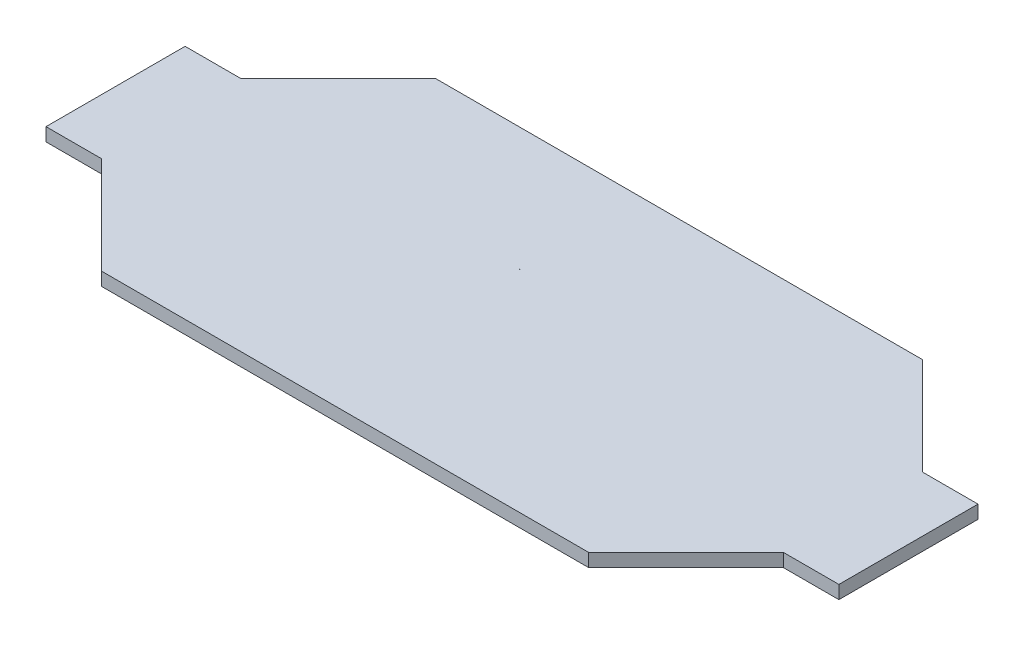
ISO-10303-21;
HEADER;
FILE_DESCRIPTION(('STEP AP214'),'2;1');
FILE_NAME('part.step','',(''),(''),'','','');
FILE_SCHEMA(('AUTOMOTIVE_DESIGN { 1 0 10303 214 1 1 1 1 }'));
ENDSEC;
DATA;
#1=APPLICATION_CONTEXT('core data for automotive mechanical design processes');
#2=APPLICATION_PROTOCOL_DEFINITION('international standard','automotive_design',2000,#1);
#3=PRODUCT_CONTEXT('',#1,'mechanical');
#4=PRODUCT('Part','Part','',(#3));
#5=PRODUCT_RELATED_PRODUCT_CATEGORY('part','',(#4));
#6=PRODUCT_DEFINITION_FORMATION('','',#4);
#7=PRODUCT_DEFINITION_CONTEXT('part definition',#1,'design');
#8=PRODUCT_DEFINITION('design','',#6,#7);
#9=PRODUCT_DEFINITION_SHAPE('','',#8);
#10=(LENGTH_UNIT() NAMED_UNIT(*) SI_UNIT(.MILLI.,.METRE.));
#11=(NAMED_UNIT(*) PLANE_ANGLE_UNIT() SI_UNIT($,.RADIAN.));
#12=(NAMED_UNIT(*) SI_UNIT($,.STERADIAN.) SOLID_ANGLE_UNIT());
#13=UNCERTAINTY_MEASURE_WITH_UNIT(LENGTH_MEASURE(1.E-05),#10,'distance_accuracy_value','');
#14=(GEOMETRIC_REPRESENTATION_CONTEXT(3) GLOBAL_UNCERTAINTY_ASSIGNED_CONTEXT((#13)) GLOBAL_UNIT_ASSIGNED_CONTEXT((#10,
#11,#12)) REPRESENTATION_CONTEXT('',''));
#15=CARTESIAN_POINT('',(0.,0.,0.));
#16=DIRECTION('',(0.,0.,1.));
#17=DIRECTION('',(1.,0.,0.));
#18=AXIS2_PLACEMENT_3D('',#15,#16,#17);
#19=CARTESIAN_POINT('',(-67.4999999999996,4.75,-67.5000000000001));
#20=DIRECTION('',(-0.707106781186545,0.,-0.70710678118655));
#21=DIRECTION('',(-0.70710678118655,0.,0.707106781186545));
#22=AXIS2_PLACEMENT_3D('',#19,#20,#21);
#23=PLANE('',#22);
#24=DIRECTION('',(0.70710678118655,0.,-0.707106781186545));
#25=VECTOR('',#24,1.);
#26=CARTESIAN_POINT('',(-67.4999999999996,0.,-67.5000000000001));
#27=LINE('',#26,#25);
#28=CARTESIAN_POINT('',(-110.,0.,-25.));
#29=VERTEX_POINT('',#28);
#30=CARTESIAN_POINT('',(-74.9999999999997,0.,-60.));
#31=VERTEX_POINT('',#30);
#32=EDGE_CURVE('E181',#29,#31,#27,.T.);
#33=ORIENTED_EDGE('',*,*,#32,.F.);
#34=DIRECTION('',(0.,-1.,0.));
#35=VECTOR('',#34,1.);
#36=CARTESIAN_POINT('',(-110.,4.75,-25.));
#37=LINE('',#36,#35);
#38=CARTESIAN_POINT('',(-110.,4.75,-25.));
#39=VERTEX_POINT('',#38);
#40=EDGE_CURVE('E11',#39,#29,#37,.T.);
#41=ORIENTED_EDGE('',*,*,#40,.F.);
#42=DIRECTION('',(0.70710678118655,0.,-0.707106781186545));
#43=VECTOR('',#42,1.);
#44=CARTESIAN_POINT('',(-67.4999999999996,4.75,-67.5000000000001));
#45=LINE('',#44,#43);
#46=CARTESIAN_POINT('',(-74.9999999999997,4.75,-60.));
#47=VERTEX_POINT('',#46);
#48=EDGE_CURVE('E293',#39,#47,#45,.T.);
#49=ORIENTED_EDGE('',*,*,#48,.T.);
#50=DIRECTION('',(0.,-1.,0.));
#51=VECTOR('',#50,1.);
#52=CARTESIAN_POINT('',(-74.9999999999997,4.75,-60.));
#53=LINE('',#52,#51);
#54=EDGE_CURVE('E57',#47,#31,#53,.T.);
#55=ORIENTED_EDGE('',*,*,#54,.T.);
#56=EDGE_LOOP('',(#33,#41,#49,#55));
#57=FACE_BOUND('',#56,.T.);
#58=ADVANCED_FACE('F38',(#57),#23,.T.);
#59=CARTESIAN_POINT('',(0.,4.75,-25.));
#60=DIRECTION('',(0.,0.,-1.));
#61=DIRECTION('',(-1.,0.,0.));
#62=AXIS2_PLACEMENT_3D('',#59,#60,#61);
#63=PLANE('',#62);
#64=DIRECTION('',(1.,0.,0.));
#65=VECTOR('',#64,1.);
#66=CARTESIAN_POINT('',(0.,0.,-25.));
#67=LINE('',#66,#65);
#68=CARTESIAN_POINT('',(-130.,0.,-25.));
#69=VERTEX_POINT('',#68);
#70=EDGE_CURVE('E183',#69,#29,#67,.T.);
#71=ORIENTED_EDGE('',*,*,#70,.F.);
#72=DIRECTION('',(0.,-1.,0.));
#73=VECTOR('',#72,1.);
#74=CARTESIAN_POINT('',(-130.,4.75,-25.));
#75=LINE('',#74,#73);
#76=CARTESIAN_POINT('',(-130.,4.75,-25.));
#77=VERTEX_POINT('',#76);
#78=EDGE_CURVE('E48',#77,#69,#75,.T.);
#79=ORIENTED_EDGE('',*,*,#78,.F.);
#80=DIRECTION('',(1.,0.,0.));
#81=VECTOR('',#80,1.);
#82=CARTESIAN_POINT('',(0.,4.75,-25.));
#83=LINE('',#82,#81);
#84=EDGE_CURVE('E297',#77,#39,#83,.T.);
#85=ORIENTED_EDGE('',*,*,#84,.T.);
#86=ORIENTED_EDGE('',*,*,#40,.T.);
#87=EDGE_LOOP('',(#71,#79,#85,#86));
#88=FACE_BOUND('',#87,.T.);
#89=ADVANCED_FACE('F246',(#88),#63,.T.);
#90=CARTESIAN_POINT('',(-130.,4.75,0.));
#91=DIRECTION('',(-1.,0.,0.));
#92=DIRECTION('',(0.,0.,1.));
#93=AXIS2_PLACEMENT_3D('',#90,#91,#92);
#94=PLANE('',#93);
#95=DIRECTION('',(0.,0.,-1.));
#96=VECTOR('',#95,1.);
#97=CARTESIAN_POINT('',(-130.,0.,0.));
#98=LINE('',#97,#96);
#99=CARTESIAN_POINT('',(-130.,0.,25.));
#100=VERTEX_POINT('',#99);
#101=EDGE_CURVE('E186',#100,#69,#98,.T.);
#102=ORIENTED_EDGE('',*,*,#101,.F.);
#103=DIRECTION('',(0.,-1.,0.));
#104=VECTOR('',#103,1.);
#105=CARTESIAN_POINT('',(-130.,4.75,25.));
#106=LINE('',#105,#104);
#107=CARTESIAN_POINT('',(-130.,4.75,25.));
#108=VERTEX_POINT('',#107);
#109=EDGE_CURVE('E227',#108,#100,#106,.T.);
#110=ORIENTED_EDGE('',*,*,#109,.F.);
#111=DIRECTION('',(0.,0.,-1.));
#112=VECTOR('',#111,1.);
#113=CARTESIAN_POINT('',(-130.,4.75,0.));
#114=LINE('',#113,#112);
#115=EDGE_CURVE('E300',#108,#77,#114,.T.);
#116=ORIENTED_EDGE('',*,*,#115,.T.);
#117=ORIENTED_EDGE('',*,*,#78,.T.);
#118=EDGE_LOOP('',(#102,#110,#116,#117));
#119=FACE_BOUND('',#118,.T.);
#120=ADVANCED_FACE('F251',(#119),#94,.T.);
#121=CARTESIAN_POINT('',(0.,4.75,25.));
#122=DIRECTION('',(0.,0.,1.));
#123=DIRECTION('',(1.,0.,0.));
#124=AXIS2_PLACEMENT_3D('',#121,#122,#123);
#125=PLANE('',#124);
#126=DIRECTION('',(-1.,0.,0.));
#127=VECTOR('',#126,1.);
#128=CARTESIAN_POINT('',(0.,0.,25.));
#129=LINE('',#128,#127);
#130=CARTESIAN_POINT('',(-110.,0.,25.));
#131=VERTEX_POINT('',#130);
#132=EDGE_CURVE('E189',#131,#100,#129,.T.);
#133=ORIENTED_EDGE('',*,*,#132,.F.);
#134=DIRECTION('',(0.,-1.,0.));
#135=VECTOR('',#134,1.);
#136=CARTESIAN_POINT('',(-110.,4.75,25.));
#137=LINE('',#136,#135);
#138=CARTESIAN_POINT('',(-110.,4.75,25.));
#139=VERTEX_POINT('',#138);
#140=EDGE_CURVE('E225',#139,#131,#137,.T.);
#141=ORIENTED_EDGE('',*,*,#140,.F.);
#142=DIRECTION('',(-1.,0.,0.));
#143=VECTOR('',#142,1.);
#144=CARTESIAN_POINT('',(0.,4.75,25.));
#145=LINE('',#144,#143);
#146=EDGE_CURVE('E303',#139,#108,#145,.T.);
#147=ORIENTED_EDGE('',*,*,#146,.T.);
#148=ORIENTED_EDGE('',*,*,#109,.T.);
#149=EDGE_LOOP('',(#133,#141,#147,#148));
#150=FACE_BOUND('',#149,.T.);
#151=ADVANCED_FACE('F257',(#150),#125,.T.);
#152=CARTESIAN_POINT('',(-67.5000000000011,4.75,67.4999999999998));
#153=DIRECTION('',(-0.707106781186554,0.,0.707106781186541));
#154=DIRECTION('',(0.707106781186541,0.,0.707106781186554));
#155=AXIS2_PLACEMENT_3D('',#152,#153,#154);
#156=PLANE('',#155);
#157=DIRECTION('',(-0.707106781186541,0.,-0.707106781186554));
#158=VECTOR('',#157,1.);
#159=CARTESIAN_POINT('',(-67.5000000000011,0.,67.4999999999998));
#160=LINE('',#159,#158);
#161=CARTESIAN_POINT('',(-75.0000000000007,0.,60.));
#162=VERTEX_POINT('',#161);
#163=EDGE_CURVE('E192',#162,#131,#160,.T.);
#164=ORIENTED_EDGE('',*,*,#163,.F.);
#165=DIRECTION('',(0.,-1.,0.));
#166=VECTOR('',#165,1.);
#167=CARTESIAN_POINT('',(-75.0000000000007,4.75,60.));
#168=LINE('',#167,#166);
#169=CARTESIAN_POINT('',(-75.0000000000007,4.75,60.));
#170=VERTEX_POINT('',#169);
#171=EDGE_CURVE('E223',#170,#162,#168,.T.);
#172=ORIENTED_EDGE('',*,*,#171,.F.);
#173=DIRECTION('',(-0.707106781186541,0.,-0.707106781186554));
#174=VECTOR('',#173,1.);
#175=CARTESIAN_POINT('',(-67.5000000000011,4.75,67.4999999999998));
#176=LINE('',#175,#174);
#177=EDGE_CURVE('E306',#170,#139,#176,.T.);
#178=ORIENTED_EDGE('',*,*,#177,.T.);
#179=ORIENTED_EDGE('',*,*,#140,.T.);
#180=EDGE_LOOP('',(#164,#172,#178,#179));
#181=FACE_BOUND('',#180,.T.);
#182=ADVANCED_FACE('F261',(#181),#156,.T.);
#183=CARTESIAN_POINT('',(0.,4.75,60.));
#184=DIRECTION('',(0.,0.,1.));
#185=DIRECTION('',(1.,0.,0.));
#186=AXIS2_PLACEMENT_3D('',#183,#184,#185);
#187=PLANE('',#186);
#188=DIRECTION('',(-1.,0.,0.));
#189=VECTOR('',#188,1.);
#190=CARTESIAN_POINT('',(0.,0.,60.));
#191=LINE('',#190,#189);
#192=CARTESIAN_POINT('',(99.9999999999993,0.,60.));
#193=VERTEX_POINT('',#192);
#194=EDGE_CURVE('E195',#193,#162,#191,.T.);
#195=ORIENTED_EDGE('',*,*,#194,.F.);
#196=DIRECTION('',(0.,-1.,0.));
#197=VECTOR('',#196,1.);
#198=CARTESIAN_POINT('',(99.9999999999993,4.75,60.));
#199=LINE('',#198,#197);
#200=CARTESIAN_POINT('',(99.9999999999993,4.75,60.));
#201=VERTEX_POINT('',#200);
#202=EDGE_CURVE('E221',#201,#193,#199,.T.);
#203=ORIENTED_EDGE('',*,*,#202,.F.);
#204=DIRECTION('',(-1.,0.,0.));
#205=VECTOR('',#204,1.);
#206=CARTESIAN_POINT('',(0.,4.75,60.));
#207=LINE('',#206,#205);
#208=EDGE_CURVE('E309',#201,#170,#207,.T.);
#209=ORIENTED_EDGE('',*,*,#208,.T.);
#210=ORIENTED_EDGE('',*,*,#171,.T.);
#211=EDGE_LOOP('',(#195,#203,#209,#210));
#212=FACE_BOUND('',#211,.T.);
#213=ADVANCED_FACE('F265',(#212),#187,.T.);
#214=CARTESIAN_POINT('',(79.9999999999987,4.75,80.0000000000002));
#215=DIRECTION('',(0.707106781186541,0.,0.707106781186554));
#216=DIRECTION('',(0.707106781186554,0.,-0.707106781186541));
#217=AXIS2_PLACEMENT_3D('',#214,#215,#216);
#218=PLANE('',#217);
#219=DIRECTION('',(-0.707106781186554,0.,0.707106781186541));
#220=VECTOR('',#219,1.);
#221=CARTESIAN_POINT('',(79.9999999999987,0.,80.0000000000002));
#222=LINE('',#221,#220);
#223=CARTESIAN_POINT('',(134.999999999999,0.,25.0000000000007));
#224=VERTEX_POINT('',#223);
#225=EDGE_CURVE('E198',#224,#193,#222,.T.);
#226=ORIENTED_EDGE('',*,*,#225,.F.);
#227=DIRECTION('',(0.,-1.,0.));
#228=VECTOR('',#227,1.);
#229=CARTESIAN_POINT('',(134.999999999999,4.75,25.0000000000007));
#230=LINE('',#229,#228);
#231=CARTESIAN_POINT('',(134.999999999999,4.75,25.0000000000007));
#232=VERTEX_POINT('',#231);
#233=EDGE_CURVE('E219',#232,#224,#230,.T.);
#234=ORIENTED_EDGE('',*,*,#233,.F.);
#235=DIRECTION('',(-0.707106781186554,0.,0.707106781186541));
#236=VECTOR('',#235,1.);
#237=CARTESIAN_POINT('',(79.9999999999987,4.75,80.0000000000002));
#238=LINE('',#237,#236);
#239=EDGE_CURVE('E312',#232,#201,#238,.T.);
#240=ORIENTED_EDGE('',*,*,#239,.T.);
#241=ORIENTED_EDGE('',*,*,#202,.T.);
#242=EDGE_LOOP('',(#226,#234,#240,#241));
#243=FACE_BOUND('',#242,.T.);
#244=ADVANCED_FACE('F269',(#243),#218,.T.);
#245=CARTESIAN_POINT('',(0.,4.75,25.0000000000007));
#246=DIRECTION('',(0.,0.,1.));
#247=DIRECTION('',(1.,0.,0.));
#248=AXIS2_PLACEMENT_3D('',#245,#246,#247);
#249=PLANE('',#248);
#250=DIRECTION('',(-1.,0.,0.));
#251=VECTOR('',#250,1.);
#252=CARTESIAN_POINT('',(0.,0.,25.0000000000007));
#253=LINE('',#252,#251);
#254=CARTESIAN_POINT('',(154.999999999999,0.,25.0000000000007));
#255=VERTEX_POINT('',#254);
#256=EDGE_CURVE('E201',#255,#224,#253,.T.);
#257=ORIENTED_EDGE('',*,*,#256,.F.);
#258=DIRECTION('',(0.,-1.,0.));
#259=VECTOR('',#258,1.);
#260=CARTESIAN_POINT('',(154.999999999999,4.75,25.0000000000007));
#261=LINE('',#260,#259);
#262=CARTESIAN_POINT('',(154.999999999999,4.75,25.0000000000007));
#263=VERTEX_POINT('',#262);
#264=EDGE_CURVE('E217',#263,#255,#261,.T.);
#265=ORIENTED_EDGE('',*,*,#264,.F.);
#266=DIRECTION('',(-1.,0.,0.));
#267=VECTOR('',#266,1.);
#268=CARTESIAN_POINT('',(0.,4.75,25.0000000000007));
#269=LINE('',#268,#267);
#270=EDGE_CURVE('E315',#263,#232,#269,.T.);
#271=ORIENTED_EDGE('',*,*,#270,.T.);
#272=ORIENTED_EDGE('',*,*,#233,.T.);
#273=EDGE_LOOP('',(#257,#265,#271,#272));
#274=FACE_BOUND('',#273,.T.);
#275=ADVANCED_FACE('F273',(#274),#249,.T.);
#276=CARTESIAN_POINT('',(154.999999999999,4.75,0.));
#277=DIRECTION('',(1.,0.,0.));
#278=DIRECTION('',(0.,0.,-1.));
#279=AXIS2_PLACEMENT_3D('',#276,#277,#278);
#280=PLANE('',#279);
#281=DIRECTION('',(0.,0.,1.));
#282=VECTOR('',#281,1.);
#283=CARTESIAN_POINT('',(154.999999999999,0.,0.));
#284=LINE('',#283,#282);
#285=CARTESIAN_POINT('',(154.999999999999,0.,-24.9999999999993));
#286=VERTEX_POINT('',#285);
#287=EDGE_CURVE('E204',#286,#255,#284,.T.);
#288=ORIENTED_EDGE('',*,*,#287,.F.);
#289=DIRECTION('',(0.,-1.,0.));
#290=VECTOR('',#289,1.);
#291=CARTESIAN_POINT('',(154.999999999999,4.75,-24.9999999999993));
#292=LINE('',#291,#290);
#293=CARTESIAN_POINT('',(154.999999999999,4.75,-24.9999999999993));
#294=VERTEX_POINT('',#293);
#295=EDGE_CURVE('E155',#294,#286,#292,.T.);
#296=ORIENTED_EDGE('',*,*,#295,.F.);
#297=DIRECTION('',(0.,0.,1.));
#298=VECTOR('',#297,1.);
#299=CARTESIAN_POINT('',(154.999999999999,4.75,0.));
#300=LINE('',#299,#298);
#301=EDGE_CURVE('E166',#294,#263,#300,.T.);
#302=ORIENTED_EDGE('',*,*,#301,.T.);
#303=ORIENTED_EDGE('',*,*,#264,.T.);
#304=EDGE_LOOP('',(#288,#296,#302,#303));
#305=FACE_BOUND('',#304,.T.);
#306=ADVANCED_FACE('F277',(#305),#280,.T.);
#307=CARTESIAN_POINT('',(0.,4.75,-24.9999999999993));
#308=DIRECTION('',(0.,0.,-1.));
#309=DIRECTION('',(-1.,0.,0.));
#310=AXIS2_PLACEMENT_3D('',#307,#308,#309);
#311=PLANE('',#310);
#312=DIRECTION('',(1.,0.,0.));
#313=VECTOR('',#312,1.);
#314=CARTESIAN_POINT('',(0.,0.,-24.9999999999993));
#315=LINE('',#314,#313);
#316=CARTESIAN_POINT('',(134.999999999999,0.,-24.9999999999994));
#317=VERTEX_POINT('',#316);
#318=EDGE_CURVE('E151',#317,#286,#315,.T.);
#319=ORIENTED_EDGE('',*,*,#318,.F.);
#320=DIRECTION('',(0.,-1.,0.));
#321=VECTOR('',#320,1.);
#322=CARTESIAN_POINT('',(134.999999999999,4.75,-24.9999999999994));
#323=LINE('',#322,#321);
#324=CARTESIAN_POINT('',(134.999999999999,4.75,-24.9999999999994));
#325=VERTEX_POINT('',#324);
#326=EDGE_CURVE('E146',#325,#317,#323,.T.);
#327=ORIENTED_EDGE('',*,*,#326,.F.);
#328=DIRECTION('',(1.,0.,0.));
#329=VECTOR('',#328,1.);
#330=CARTESIAN_POINT('',(0.,4.75,-24.9999999999993));
#331=LINE('',#330,#329);
#332=EDGE_CURVE('E149',#325,#294,#331,.T.);
#333=ORIENTED_EDGE('',*,*,#332,.T.);
#334=ORIENTED_EDGE('',*,*,#295,.T.);
#335=EDGE_LOOP('',(#319,#327,#333,#334));
#336=FACE_BOUND('',#335,.T.);
#337=ADVANCED_FACE('F148',(#336),#311,.T.);
#338=CARTESIAN_POINT('',(80.0000000000023,4.75,-79.9999999999988));
#339=DIRECTION('',(0.707106781186563,0.,-0.707106781186532));
#340=DIRECTION('',(-0.707106781186532,0.,-0.707106781186563));
#341=AXIS2_PLACEMENT_3D('',#338,#339,#340);
#342=PLANE('',#341);
#343=DIRECTION('',(0.707106781186532,0.,0.707106781186563));
#344=VECTOR('',#343,1.);
#345=CARTESIAN_POINT('',(80.0000000000023,0.,-79.9999999999988));
#346=LINE('',#345,#344);
#347=CARTESIAN_POINT('',(100.,0.,-60.));
#348=VERTEX_POINT('',#347);
#349=EDGE_CURVE('E208',#348,#317,#346,.T.);
#350=ORIENTED_EDGE('',*,*,#349,.F.);
#351=DIRECTION('',(0.,-1.,0.));
#352=VECTOR('',#351,1.);
#353=CARTESIAN_POINT('',(100.,4.75,-60.));
#354=LINE('',#353,#352);
#355=CARTESIAN_POINT('',(100.,4.75,-60.));
#356=VERTEX_POINT('',#355);
#357=EDGE_CURVE('E100',#356,#348,#354,.T.);
#358=ORIENTED_EDGE('',*,*,#357,.F.);
#359=DIRECTION('',(0.707106781186532,0.,0.707106781186563));
#360=VECTOR('',#359,1.);
#361=CARTESIAN_POINT('',(80.0000000000023,4.75,-79.9999999999988));
#362=LINE('',#361,#360);
#363=EDGE_CURVE('E163',#356,#325,#362,.T.);
#364=ORIENTED_EDGE('',*,*,#363,.T.);
#365=ORIENTED_EDGE('',*,*,#326,.T.);
#366=EDGE_LOOP('',(#350,#358,#364,#365));
#367=FACE_BOUND('',#366,.T.);
#368=ADVANCED_FACE('F168',(#367),#342,.T.);
#369=CARTESIAN_POINT('',(-0.437294407438941,4.75,-16.2942805630547));
#370=DIRECTION('',(0.,-1.,0.));
#371=DIRECTION('',(0.,0.,-1.));
#372=AXIS2_PLACEMENT_3D('',#369,#370,#371);
#373=CYLINDRICAL_SURFACE('',#372,0.593472227818326);
#374=CARTESIAN_POINT('',(-0.437294407438941,0.,-16.2942805630547));
#375=DIRECTION('',(0.,1.,0.));
#376=DIRECTION('',(0.,0.,1.));
#377=AXIS2_PLACEMENT_3D('',#374,#375,#376);
#378=CIRCLE('',#377,0.593472227818326);
#379=CARTESIAN_POINT('',(-0.778483363992673,0.,-15.8086887786129));
#380=VERTEX_POINT('',#379);
#381=CARTESIAN_POINT('',(-0.0961054508852114,0.,-15.8086887786129));
#382=VERTEX_POINT('',#381);
#383=EDGE_CURVE('E175',#380,#382,#378,.T.);
#384=ORIENTED_EDGE('',*,*,#383,.F.);
#385=DIRECTION('',(0.,-1.,0.));
#386=VECTOR('',#385,1.);
#387=CARTESIAN_POINT('',(-0.778483363992673,4.75,-15.8086887786129));
#388=LINE('',#387,#386);
#389=CARTESIAN_POINT('',(-0.778483363992673,4.75,-15.8086887786129));
#390=VERTEX_POINT('',#389);
#391=EDGE_CURVE('E42',#390,#380,#388,.T.);
#392=ORIENTED_EDGE('',*,*,#391,.F.);
#393=CARTESIAN_POINT('',(-0.437294407438941,4.75,-16.2942805630547));
#394=DIRECTION('',(0.,1.,0.));
#395=DIRECTION('',(0.,0.,1.));
#396=AXIS2_PLACEMENT_3D('',#393,#394,#395);
#397=CIRCLE('',#396,0.593472227818326);
#398=CARTESIAN_POINT('',(-0.0961054508852114,4.75,-15.8086887786129));
#399=VERTEX_POINT('',#398);
#400=EDGE_CURVE('E213',#390,#399,#397,.T.);
#401=ORIENTED_EDGE('',*,*,#400,.T.);
#402=DIRECTION('',(0.,-1.,0.));
#403=VECTOR('',#402,1.);
#404=CARTESIAN_POINT('',(-0.0961054508852114,4.75,-15.8086887786129));
#405=LINE('',#404,#403);
#406=EDGE_CURVE('E171',#399,#382,#405,.T.);
#407=ORIENTED_EDGE('',*,*,#406,.T.);
#408=EDGE_LOOP('',(#384,#392,#401,#407));
#409=FACE_BOUND('',#408,.T.);
#410=ADVANCED_FACE('F40',(#409),#373,.F.);
#411=CARTESIAN_POINT('',(0.,4.75,-15.8086887786129));
#412=DIRECTION('',(0.,0.,-1.));
#413=DIRECTION('',(-1.,0.,0.));
#414=AXIS2_PLACEMENT_3D('',#411,#412,#413);
#415=PLANE('',#414);
#416=DIRECTION('',(1.,0.,0.));
#417=VECTOR('',#416,1.);
#418=CARTESIAN_POINT('',(0.,0.,-15.8086887786129));
#419=LINE('',#418,#417);
#420=EDGE_CURVE('E178',#380,#382,#419,.T.);
#421=ORIENTED_EDGE('',*,*,#420,.T.);
#422=ORIENTED_EDGE('',*,*,#406,.F.);
#423=DIRECTION('',(1.,0.,0.));
#424=VECTOR('',#423,1.);
#425=CARTESIAN_POINT('',(0.,4.75,-15.8086887786129));
#426=LINE('',#425,#424);
#427=EDGE_CURVE('E233',#390,#399,#426,.T.);
#428=ORIENTED_EDGE('',*,*,#427,.F.);
#429=ORIENTED_EDGE('',*,*,#391,.T.);
#430=EDGE_LOOP('',(#421,#422,#428,#429));
#431=FACE_BOUND('',#430,.T.);
#432=ADVANCED_FACE('F232',(#431),#415,.F.);
#433=CARTESIAN_POINT('',(0.,4.75,-60.));
#434=DIRECTION('',(0.,0.,-1.));
#435=DIRECTION('',(-1.,0.,0.));
#436=AXIS2_PLACEMENT_3D('',#433,#434,#435);
#437=PLANE('',#436);
#438=DIRECTION('',(1.,0.,0.));
#439=VECTOR('',#438,1.);
#440=CARTESIAN_POINT('',(0.,0.,-60.));
#441=LINE('',#440,#439);
#442=EDGE_CURVE('E210',#31,#348,#441,.T.);
#443=ORIENTED_EDGE('',*,*,#442,.F.);
#444=ORIENTED_EDGE('',*,*,#54,.F.);
#445=DIRECTION('',(1.,0.,0.));
#446=VECTOR('',#445,1.);
#447=CARTESIAN_POINT('',(0.,4.75,-60.));
#448=LINE('',#447,#446);
#449=EDGE_CURVE('E169',#47,#356,#448,.T.);
#450=ORIENTED_EDGE('',*,*,#449,.T.);
#451=ORIENTED_EDGE('',*,*,#357,.T.);
#452=EDGE_LOOP('',(#443,#444,#450,#451));
#453=FACE_BOUND('',#452,.T.);
#454=ADVANCED_FACE('F243',(#453),#437,.T.);
#455=CARTESIAN_POINT('',(0.,4.75,0.));
#456=DIRECTION('',(0.,1.,0.));
#457=DIRECTION('',(0.,0.,1.));
#458=AXIS2_PLACEMENT_3D('',#455,#456,#457);
#459=PLANE('',#458);
#460=ORIENTED_EDGE('',*,*,#400,.F.);
#461=ORIENTED_EDGE('',*,*,#427,.T.);
#462=EDGE_LOOP('',(#460,#461));
#463=FACE_BOUND('',#462,.T.);
#464=ORIENTED_EDGE('',*,*,#48,.F.);
#465=ORIENTED_EDGE('',*,*,#84,.F.);
#466=ORIENTED_EDGE('',*,*,#115,.F.);
#467=ORIENTED_EDGE('',*,*,#146,.F.);
#468=ORIENTED_EDGE('',*,*,#177,.F.);
#469=ORIENTED_EDGE('',*,*,#208,.F.);
#470=ORIENTED_EDGE('',*,*,#239,.F.);
#471=ORIENTED_EDGE('',*,*,#270,.F.);
#472=ORIENTED_EDGE('',*,*,#301,.F.);
#473=ORIENTED_EDGE('',*,*,#332,.F.);
#474=ORIENTED_EDGE('',*,*,#363,.F.);
#475=ORIENTED_EDGE('',*,*,#449,.F.);
#476=EDGE_LOOP('',(#464,#465,#466,#467,#468,#469,#470,#471,#472,#473,#474,#475));
#477=FACE_BOUND('',#476,.T.);
#478=ADVANCED_FACE('F161',(#463,#477),#459,.T.);
#479=CARTESIAN_POINT('',(0.,0.,0.));
#480=DIRECTION('',(0.,1.,0.));
#481=DIRECTION('',(0.,0.,1.));
#482=AXIS2_PLACEMENT_3D('',#479,#480,#481);
#483=PLANE('',#482);
#484=ORIENTED_EDGE('',*,*,#383,.T.);
#485=ORIENTED_EDGE('',*,*,#420,.F.);
#486=EDGE_LOOP('',(#484,#485));
#487=FACE_BOUND('',#486,.T.);
#488=ORIENTED_EDGE('',*,*,#32,.T.);
#489=ORIENTED_EDGE('',*,*,#442,.T.);
#490=ORIENTED_EDGE('',*,*,#349,.T.);
#491=ORIENTED_EDGE('',*,*,#318,.T.);
#492=ORIENTED_EDGE('',*,*,#287,.T.);
#493=ORIENTED_EDGE('',*,*,#256,.T.);
#494=ORIENTED_EDGE('',*,*,#225,.T.);
#495=ORIENTED_EDGE('',*,*,#194,.T.);
#496=ORIENTED_EDGE('',*,*,#163,.T.);
#497=ORIENTED_EDGE('',*,*,#132,.T.);
#498=ORIENTED_EDGE('',*,*,#101,.T.);
#499=ORIENTED_EDGE('',*,*,#70,.T.);
#500=EDGE_LOOP('',(#488,#489,#490,#491,#492,#493,#494,#495,#496,#497,#498,#499));
#501=FACE_BOUND('',#500,.T.);
#502=ADVANCED_FACE('F236',(#487,#501),#483,.F.);
#503=CLOSED_SHELL('',(#58,#89,#120,#151,#182,#213,#244,#275,#306,#337,#368,#410,#432,#454,#478,#502));
#504=MANIFOLD_SOLID_BREP('B2',#503);
#505=ADVANCED_BREP_SHAPE_REPRESENTATION('',(#18,#504),#14);
#506=SHAPE_DEFINITION_REPRESENTATION(#9,#505);
ENDSEC;
END-ISO-10303-21;
